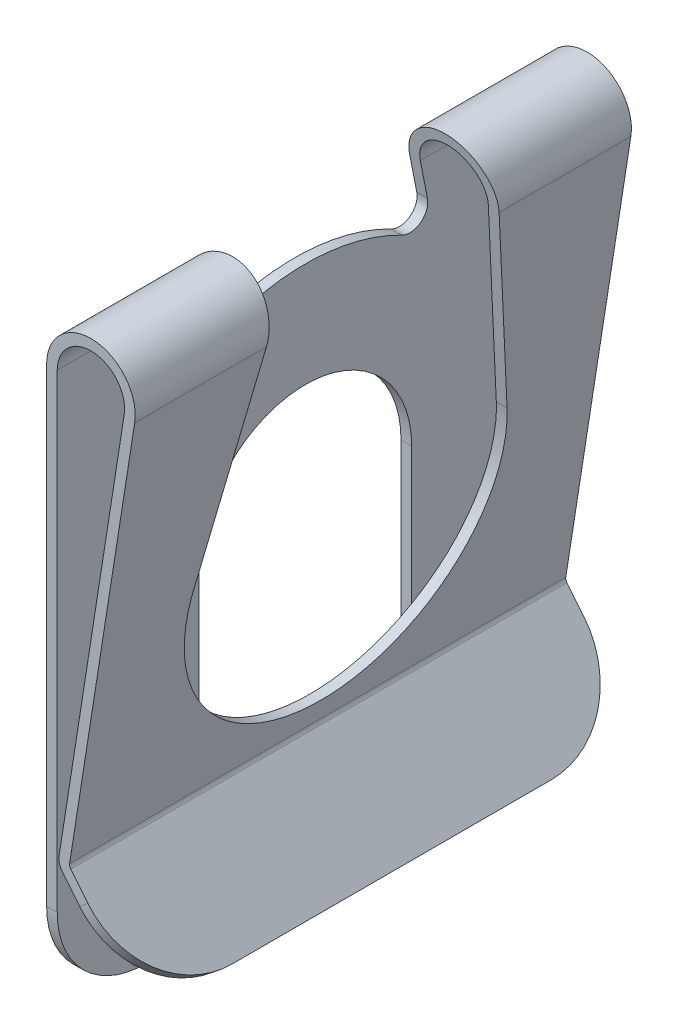
ISO-10303-21;
HEADER;
FILE_DESCRIPTION(('STEP AP214'),'2;1');
FILE_NAME('part.step','',(''),(''),'','','');
FILE_SCHEMA(('AUTOMOTIVE_DESIGN { 1 0 10303 214 1 1 1 1 }'));
ENDSEC;
DATA;
#1=APPLICATION_CONTEXT('core data for automotive mechanical design processes');
#2=APPLICATION_PROTOCOL_DEFINITION('international standard','automotive_design',2000,#1);
#3=PRODUCT_CONTEXT('',#1,'mechanical');
#4=PRODUCT('Part','Part','',(#3));
#5=PRODUCT_RELATED_PRODUCT_CATEGORY('part','',(#4));
#6=PRODUCT_DEFINITION_FORMATION('','',#4);
#7=PRODUCT_DEFINITION_CONTEXT('part definition',#1,'design');
#8=PRODUCT_DEFINITION('design','',#6,#7);
#9=PRODUCT_DEFINITION_SHAPE('','',#8);
#10=(LENGTH_UNIT() NAMED_UNIT(*) SI_UNIT(.MILLI.,.METRE.));
#11=(NAMED_UNIT(*) PLANE_ANGLE_UNIT() SI_UNIT($,.RADIAN.));
#12=(NAMED_UNIT(*) SI_UNIT($,.STERADIAN.) SOLID_ANGLE_UNIT());
#13=UNCERTAINTY_MEASURE_WITH_UNIT(LENGTH_MEASURE(1.E-05),#10,'distance_accuracy_value','');
#14=(GEOMETRIC_REPRESENTATION_CONTEXT(3) GLOBAL_UNCERTAINTY_ASSIGNED_CONTEXT((#13)) GLOBAL_UNIT_ASSIGNED_CONTEXT((#10,
#11,#12)) REPRESENTATION_CONTEXT('',''));
#15=CARTESIAN_POINT('',(0.,0.,0.));
#16=DIRECTION('',(0.,0.,1.));
#17=DIRECTION('',(1.,0.,0.));
#18=AXIS2_PLACEMENT_3D('',#15,#16,#17);
#19=CARTESIAN_POINT('',(0.895029627833517,-10.6822163194488,14.));
#20=DIRECTION('',(0.775470518432176,0.631383777937422,0.));
#21=DIRECTION('',(-0.631383777937422,0.775470518432177,0.));
#22=AXIS2_PLACEMENT_3D('',#19,#20,#21);
#23=PLANE('',#22);
#24=CARTESIAN_POINT('',(1.86230957563363,-11.8702371536869,8.99999999999994));
#25=DIRECTION('',(0.775470518432176,0.631383777937422,0.));
#26=DIRECTION('',(-0.631383777937422,0.775470518432177,0.));
#27=AXIS2_PLACEMENT_3D('',#24,#25,#26);
#28=CIRCLE('',#27,5.00000000000006);
#29=CARTESIAN_POINT('',(1.86230957563367,-11.8702371536869,14.));
#30=VERTEX_POINT('',#29);
#31=CARTESIAN_POINT('',(5.01922846532078,-15.7475897458478,9.));
#32=VERTEX_POINT('',#31);
#33=EDGE_CURVE('E405',#30,#32,#28,.T.);
#34=ORIENTED_EDGE('',*,*,#33,.F.);
#35=DIRECTION('',(0.631383777937422,-0.775470518432176,0.));
#36=VECTOR('',#35,1.);
#37=CARTESIAN_POINT('',(0.895029627833517,-10.6822163194488,14.));
#38=LINE('',#37,#36);
#39=CARTESIAN_POINT('',(0.895029627833517,-10.6822163194488,14.));
#40=VERTEX_POINT('',#39);
#41=EDGE_CURVE('E288',#40,#30,#38,.T.);
#42=ORIENTED_EDGE('',*,*,#41,.F.);
#43=DIRECTION('',(0.,0.,-1.));
#44=VECTOR('',#43,1.);
#45=CARTESIAN_POINT('',(0.895029627833517,-10.6822163194488,14.));
#46=LINE('',#45,#44);
#47=CARTESIAN_POINT('',(0.895029627833517,-10.6822163194488,-14.));
#48=VERTEX_POINT('',#47);
#49=EDGE_CURVE('E305',#40,#48,#46,.T.);
#50=ORIENTED_EDGE('',*,*,#49,.T.);
#51=DIRECTION('',(0.631383777937422,-0.775470518432176,0.));
#52=VECTOR('',#51,1.);
#53=CARTESIAN_POINT('',(0.895029627833517,-10.6822163194488,-14.));
#54=LINE('',#53,#52);
#55=CARTESIAN_POINT('',(1.86230957563368,-11.8702371536869,-14.));
#56=VERTEX_POINT('',#55);
#57=EDGE_CURVE('E264',#48,#56,#54,.T.);
#58=ORIENTED_EDGE('',*,*,#57,.T.);
#59=CARTESIAN_POINT('',(1.86230957563368,-11.8702371536869,-9.00000000000001));
#60=DIRECTION('',(0.775470518432176,0.631383777937422,0.));
#61=DIRECTION('',(-0.631383777937422,0.775470518432177,0.));
#62=AXIS2_PLACEMENT_3D('',#59,#60,#61);
#63=CIRCLE('',#62,5.);
#64=CARTESIAN_POINT('',(5.01922846532079,-15.7475897458478,-9.00000000000001));
#65=VERTEX_POINT('',#64);
#66=EDGE_CURVE('E48',#65,#56,#63,.T.);
#67=ORIENTED_EDGE('',*,*,#66,.F.);
#68=DIRECTION('',(0.,0.,-1.));
#69=VECTOR('',#68,1.);
#70=CARTESIAN_POINT('',(5.01922846532079,-15.7475897458478,14.));
#71=LINE('',#70,#69);
#72=EDGE_CURVE('E406',#32,#65,#71,.T.);
#73=ORIENTED_EDGE('',*,*,#72,.F.);
#74=EDGE_LOOP('',(#34,#42,#50,#58,#67,#73));
#75=FACE_BOUND('',#74,.T.);
#76=ADVANCED_FACE('F33',(#75),#23,.F.);
#77=CARTESIAN_POINT('',(5.5015602883906,-15.3896998237376,14.));
#78=DIRECTION('',(-0.775470518432177,-0.631383777937422,0.));
#79=DIRECTION('',(0.631383777937422,-0.775470518432177,0.));
#80=AXIS2_PLACEMENT_3D('',#77,#78,#79);
#81=PLANE('',#80);
#82=CARTESIAN_POINT('',(2.32759188669291,-11.4914068869244,8.99999999999994));
#83=DIRECTION('',(-0.775470518432177,-0.631383777937422,0.));
#84=DIRECTION('',(0.631383777937422,-0.775470518432177,0.));
#85=AXIS2_PLACEMENT_3D('',#82,#83,#84);
#86=CIRCLE('',#85,5.00000000000006);
#87=CARTESIAN_POINT('',(5.48451077638006,-15.3687594790854,9.));
#88=VERTEX_POINT('',#87);
#89=CARTESIAN_POINT('',(2.32759188669295,-11.4914068869245,14.));
#90=VERTEX_POINT('',#89);
#91=EDGE_CURVE('E341',#88,#90,#86,.T.);
#92=ORIENTED_EDGE('',*,*,#91,.F.);
#93=DIRECTION('',(0.,0.,1.));
#94=VECTOR('',#93,1.);
#95=CARTESIAN_POINT('',(5.48451077638006,-15.3687594790854,14.));
#96=LINE('',#95,#94);
#97=CARTESIAN_POINT('',(5.48451077638006,-15.3687594790854,-9.00000000000001));
#98=VERTEX_POINT('',#97);
#99=EDGE_CURVE('E11',#98,#88,#96,.T.);
#100=ORIENTED_EDGE('',*,*,#99,.F.);
#101=CARTESIAN_POINT('',(2.32759188669296,-11.4914068869245,-9.00000000000001));
#102=DIRECTION('',(-0.775470518432177,-0.631383777937422,0.));
#103=DIRECTION('',(0.631383777937422,-0.775470518432177,0.));
#104=AXIS2_PLACEMENT_3D('',#101,#102,#103);
#105=CIRCLE('',#104,5.);
#106=CARTESIAN_POINT('',(2.32759188669295,-11.4914068869245,-14.));
#107=VERTEX_POINT('',#106);
#108=EDGE_CURVE('E242',#107,#98,#105,.T.);
#109=ORIENTED_EDGE('',*,*,#108,.F.);
#110=DIRECTION('',(-0.631383777937421,0.775470518432177,0.));
#111=VECTOR('',#110,1.);
#112=CARTESIAN_POINT('',(5.5015602883906,-15.3896998237376,-14.));
#113=LINE('',#112,#111);
#114=CARTESIAN_POINT('',(1.36031193889282,-10.3033860526864,-14.));
#115=VERTEX_POINT('',#114);
#116=EDGE_CURVE('E255',#107,#115,#113,.T.);
#117=ORIENTED_EDGE('',*,*,#116,.T.);
#118=DIRECTION('',(0.,0.,-1.));
#119=VECTOR('',#118,1.);
#120=CARTESIAN_POINT('',(1.36031193889282,-10.3033860526864,14.));
#121=LINE('',#120,#119);
#122=CARTESIAN_POINT('',(1.36031193889282,-10.3033860526864,14.));
#123=VERTEX_POINT('',#122);
#124=EDGE_CURVE('E303',#123,#115,#121,.T.);
#125=ORIENTED_EDGE('',*,*,#124,.F.);
#126=DIRECTION('',(-0.631383777937421,0.775470518432177,0.));
#127=VECTOR('',#126,1.);
#128=CARTESIAN_POINT('',(5.5015602883906,-15.3896998237376,14.));
#129=LINE('',#128,#127);
#130=EDGE_CURVE('E291',#90,#123,#129,.T.);
#131=ORIENTED_EDGE('',*,*,#130,.F.);
#132=EDGE_LOOP('',(#92,#100,#109,#117,#125,#131));
#133=FACE_BOUND('',#132,.T.);
#134=ADVANCED_FACE('F253',(#133),#81,.F.);
#135=CARTESIAN_POINT('',(2.5,13.7,14.));
#136=DIRECTION('',(0.,0.,1.));
#137=DIRECTION('',(1.,0.,0.));
#138=AXIS2_PLACEMENT_3D('',#135,#136,#137);
#139=PLANE('',#138);
#140=ORIENTED_EDGE('',*,*,#41,.T.);
#141=DIRECTION('',(0.775470518432175,0.631383777937423,0.));
#142=VECTOR('',#141,1.);
#143=CARTESIAN_POINT('',(14.7654744712852,-1.36455214629673,14.));
#144=LINE('',#143,#142);
#145=EDGE_CURVE('E41',#30,#90,#144,.T.);
#146=ORIENTED_EDGE('',*,*,#145,.T.);
#147=ORIENTED_EDGE('',*,*,#130,.T.);
#148=CARTESIAN_POINT('',(1.59295309442247,-10.1139709193051,14.));
#149=DIRECTION('',(0.,0.,-1.));
#150=DIRECTION('',(-1.,0.,0.));
#151=AXIS2_PLACEMENT_3D('',#148,#149,#150);
#152=CIRCLE('',#151,0.300000000000011);
#153=CARTESIAN_POINT('',(1.29658842523851,-10.0674093164602,14.));
#154=VERTEX_POINT('',#153);
#155=EDGE_CURVE('E293',#123,#154,#152,.T.);
#156=ORIENTED_EDGE('',*,*,#155,.T.);
#157=DIRECTION('',(0.15520534281649,0.987882230613152,0.));
#158=VECTOR('',#157,1.);
#159=CARTESIAN_POINT('',(1.29658842523853,-10.0674093164602,14.));
#160=LINE('',#159,#158);
#161=CARTESIAN_POINT('',(4.96970557653288,13.3119866429588,14.));
#162=VERTEX_POINT('',#161);
#163=EDGE_CURVE('E295',#154,#162,#160,.T.);
#164=ORIENTED_EDGE('',*,*,#163,.T.);
#165=CARTESIAN_POINT('',(2.5,13.7,14.));
#166=DIRECTION('',(0.,0.,1.));
#167=DIRECTION('',(1.,0.,0.));
#168=AXIS2_PLACEMENT_3D('',#165,#166,#167);
#169=CIRCLE('',#168,2.5);
#170=CARTESIAN_POINT('',(0.,13.7,14.));
#171=VERTEX_POINT('',#170);
#172=EDGE_CURVE('E274',#162,#171,#169,.T.);
#173=ORIENTED_EDGE('',*,*,#172,.T.);
#174=DIRECTION('',(0.,-1.,0.));
#175=VECTOR('',#174,1.);
#176=CARTESIAN_POINT('',(0.,13.7,14.));
#177=LINE('',#176,#175);
#178=CARTESIAN_POINT('',(0.,-12.7999999999999,14.));
#179=VERTEX_POINT('',#178);
#180=EDGE_CURVE('E277',#171,#179,#177,.T.);
#181=ORIENTED_EDGE('',*,*,#180,.T.);
#182=DIRECTION('',(-1.,0.,0.));
#183=VECTOR('',#182,1.);
#184=CARTESIAN_POINT('',(0.6,-12.7999999999999,14.));
#185=LINE('',#184,#183);
#186=CARTESIAN_POINT('',(0.6,-12.7999999999999,14.));
#187=VERTEX_POINT('',#186);
#188=EDGE_CURVE('E368',#187,#179,#185,.T.);
#189=ORIENTED_EDGE('',*,*,#188,.F.);
#190=DIRECTION('',(0.,1.,0.));
#191=VECTOR('',#190,1.);
#192=CARTESIAN_POINT('',(0.6,-17.8,14.));
#193=LINE('',#192,#191);
#194=CARTESIAN_POINT('',(0.6,13.7,14.));
#195=VERTEX_POINT('',#194);
#196=EDGE_CURVE('E280',#187,#195,#193,.T.);
#197=ORIENTED_EDGE('',*,*,#196,.T.);
#198=CARTESIAN_POINT('',(2.5,13.7,14.));
#199=DIRECTION('',(0.,0.,-1.));
#200=DIRECTION('',(-1.,0.,0.));
#201=AXIS2_PLACEMENT_3D('',#198,#199,#200);
#202=CIRCLE('',#201,1.9);
#203=CARTESIAN_POINT('',(4.37697623816499,13.4051098486487,14.));
#204=VERTEX_POINT('',#203);
#205=EDGE_CURVE('E282',#195,#204,#202,.T.);
#206=ORIENTED_EDGE('',*,*,#205,.T.);
#207=DIRECTION('',(-0.15520534281649,-0.987882230613152,0.));
#208=VECTOR('',#207,1.);
#209=CARTESIAN_POINT('',(4.37697623816499,13.4051098486487,14.));
#210=LINE('',#209,#208);
#211=CARTESIAN_POINT('',(0.70385908687064,-9.9742861107703,14.));
#212=VERTEX_POINT('',#211);
#213=EDGE_CURVE('E284',#204,#212,#210,.T.);
#214=ORIENTED_EDGE('',*,*,#213,.T.);
#215=CARTESIAN_POINT('',(1.59295309442247,-10.1139709193051,14.));
#216=DIRECTION('',(0.,0.,1.));
#217=DIRECTION('',(1.,0.,0.));
#218=AXIS2_PLACEMENT_3D('',#215,#216,#217);
#219=CIRCLE('',#218,0.899999999999994);
#220=EDGE_CURVE('E286',#212,#40,#219,.T.);
#221=ORIENTED_EDGE('',*,*,#220,.T.);
#222=EDGE_LOOP('',(#140,#146,#147,#156,#164,#173,#181,#189,#197,#206,#214,#221));
#223=FACE_BOUND('',#222,.T.);
#224=ADVANCED_FACE('F337',(#223),#139,.T.);
#225=CARTESIAN_POINT('',(0.,13.7,14.));
#226=DIRECTION('',(1.,0.,0.));
#227=DIRECTION('',(0.,0.,-1.));
#228=AXIS2_PLACEMENT_3D('',#225,#226,#227);
#229=PLANE('',#228);
#230=CARTESIAN_POINT('',(0.,-16.8000000000001,6.99999999999991));
#231=DIRECTION('',(-1.,0.,0.));
#232=DIRECTION('',(0.,0.,1.));
#233=AXIS2_PLACEMENT_3D('',#230,#231,#232);
#234=CIRCLE('',#233,0.999999999999907);
#235=CARTESIAN_POINT('',(0.,-16.8,6.));
#236=VERTEX_POINT('',#235);
#237=CARTESIAN_POINT('',(0.,-17.8,7.));
#238=VERTEX_POINT('',#237);
#239=EDGE_CURVE('E56',#236,#238,#234,.T.);
#240=ORIENTED_EDGE('',*,*,#239,.T.);
#241=DIRECTION('',(0.,0.,-1.));
#242=VECTOR('',#241,1.);
#243=CARTESIAN_POINT('',(0.,-17.8,14.));
#244=LINE('',#243,#242);
#245=CARTESIAN_POINT('',(0.,-17.8,9.));
#246=VERTEX_POINT('',#245);
#247=EDGE_CURVE('E322',#246,#238,#244,.T.);
#248=ORIENTED_EDGE('',*,*,#247,.F.);
#249=CARTESIAN_POINT('',(0.,-12.7999999999999,8.99999999999987));
#250=DIRECTION('',(-1.,0.,0.));
#251=DIRECTION('',(0.,0.,1.));
#252=AXIS2_PLACEMENT_3D('',#249,#250,#251);
#253=CIRCLE('',#252,5.00000000000013);
#254=EDGE_CURVE('E366',#246,#179,#253,.T.);
#255=ORIENTED_EDGE('',*,*,#254,.T.);
#256=ORIENTED_EDGE('',*,*,#180,.F.);
#257=DIRECTION('',(0.,0.,-1.));
#258=VECTOR('',#257,1.);
#259=CARTESIAN_POINT('',(0.,13.7,14.));
#260=LINE('',#259,#258);
#261=CARTESIAN_POINT('',(0.,13.7,6.48931632848877));
#262=VERTEX_POINT('',#261);
#263=EDGE_CURVE('E326',#171,#262,#260,.T.);
#264=ORIENTED_EDGE('',*,*,#263,.T.);
#265=DIRECTION('',(0.,-0.981378901425819,0.192081888360808));
#266=VECTOR('',#265,1.);
#267=CARTESIAN_POINT('',(0.,12.284197728924,6.76642639614835));
#268=LINE('',#267,#266);
#269=CARTESIAN_POINT('',(0.,11.6600781321456,6.88858316000175));
#270=VERTEX_POINT('',#269);
#271=EDGE_CURVE('E363',#262,#270,#268,.T.);
#272=ORIENTED_EDGE('',*,*,#271,.T.);
#273=CARTESIAN_POINT('',(0.,11.4679962437848,5.90720425857591));
#274=DIRECTION('',(1.,0.,0.));
#275=DIRECTION('',(0.,0.,-1.));
#276=AXIS2_PLACEMENT_3D('',#273,#274,#275);
#277=CIRCLE('',#276,1.00000000000001);
#278=CARTESIAN_POINT('',(0.,10.5790043133299,5.44928139652815));
#279=VERTEX_POINT('',#278);
#280=EDGE_CURVE('E477',#270,#279,#277,.T.);
#281=ORIENTED_EDGE('',*,*,#280,.T.);
#282=CARTESIAN_POINT('',(0.,-2.37657116208823E-13,0.));
#283=DIRECTION('',(1.,0.,0.));
#284=DIRECTION('',(0.,0.,-1.));
#285=AXIS2_PLACEMENT_3D('',#282,#283,#284);
#286=CIRCLE('',#285,11.9000000000002);
#287=CARTESIAN_POINT('',(0.,10.5790042869023,-5.44928144783361));
#288=VERTEX_POINT('',#287);
#289=EDGE_CURVE('E462',#279,#288,#286,.F.);
#290=ORIENTED_EDGE('',*,*,#289,.T.);
#291=CARTESIAN_POINT('',(0.,11.4679962437848,-5.90720425857592));
#292=DIRECTION('',(1.,0.,0.));
#293=DIRECTION('',(0.,0.,-1.));
#294=AXIS2_PLACEMENT_3D('',#291,#292,#293);
#295=CIRCLE('',#294,1.);
#296=CARTESIAN_POINT('',(0.,11.6600781321456,-6.88858316000175));
#297=VERTEX_POINT('',#296);
#298=EDGE_CURVE('E470',#288,#297,#295,.T.);
#299=ORIENTED_EDGE('',*,*,#298,.T.);
#300=DIRECTION('',(0.,0.981378901425819,0.192081888360808));
#301=VECTOR('',#300,1.);
#302=CARTESIAN_POINT('',(0.,17.5623408812572,-5.73335374473324));
#303=LINE('',#302,#301);
#304=CARTESIAN_POINT('',(0.,13.7,-6.48931632848876));
#305=VERTEX_POINT('',#304);
#306=EDGE_CURVE('E473',#297,#305,#303,.T.);
#307=ORIENTED_EDGE('',*,*,#306,.T.);
#308=CARTESIAN_POINT('',(0.,13.7,-14.));
#309=VERTEX_POINT('',#308);
#310=EDGE_CURVE('E325',#305,#309,#260,.T.);
#311=ORIENTED_EDGE('',*,*,#310,.T.);
#312=DIRECTION('',(0.,-1.,0.));
#313=VECTOR('',#312,1.);
#314=CARTESIAN_POINT('',(0.,13.7,-14.));
#315=LINE('',#314,#313);
#316=CARTESIAN_POINT('',(0.,-12.8,-14.));
#317=VERTEX_POINT('',#316);
#318=EDGE_CURVE('E522',#309,#317,#315,.T.);
#319=ORIENTED_EDGE('',*,*,#318,.T.);
#320=CARTESIAN_POINT('',(0.,-12.7999999999999,-8.99999999999987));
#321=DIRECTION('',(-1.,0.,0.));
#322=DIRECTION('',(0.,0.,1.));
#323=AXIS2_PLACEMENT_3D('',#320,#321,#322);
#324=CIRCLE('',#323,5.00000000000013);
#325=CARTESIAN_POINT('',(0.,-17.8,-9.));
#326=VERTEX_POINT('',#325);
#327=EDGE_CURVE('E431',#317,#326,#324,.T.);
#328=ORIENTED_EDGE('',*,*,#327,.T.);
#329=CARTESIAN_POINT('',(0.,-17.8,-7.));
#330=VERTEX_POINT('',#329);
#331=EDGE_CURVE('E321',#330,#326,#244,.T.);
#332=ORIENTED_EDGE('',*,*,#331,.F.);
#333=CARTESIAN_POINT('',(0.,-16.7999999999999,-7.00000000000008));
#334=DIRECTION('',(-1.,0.,0.));
#335=DIRECTION('',(0.,0.,1.));
#336=AXIS2_PLACEMENT_3D('',#333,#334,#335);
#337=CIRCLE('',#336,1.00000000000008);
#338=CARTESIAN_POINT('',(0.,-16.7999999999999,-6.));
#339=VERTEX_POINT('',#338);
#340=EDGE_CURVE('E421',#330,#339,#337,.T.);
#341=ORIENTED_EDGE('',*,*,#340,.T.);
#342=DIRECTION('',(0.,1.,0.));
#343=VECTOR('',#342,1.);
#344=CARTESIAN_POINT('',(0.,-17.8,-6.));
#345=LINE('',#344,#343);
#346=CARTESIAN_POINT('',(0.,0.,-6.));
#347=VERTEX_POINT('',#346);
#348=EDGE_CURVE('E502',#339,#347,#345,.T.);
#349=ORIENTED_EDGE('',*,*,#348,.T.);
#350=CARTESIAN_POINT('',(0.,0.,0.));
#351=DIRECTION('',(1.,0.,0.));
#352=DIRECTION('',(0.,0.,-1.));
#353=AXIS2_PLACEMENT_3D('',#350,#351,#352);
#354=CIRCLE('',#353,6.);
#355=CARTESIAN_POINT('',(0.,0.,6.));
#356=VERTEX_POINT('',#355);
#357=EDGE_CURVE('E498',#347,#356,#354,.T.);
#358=ORIENTED_EDGE('',*,*,#357,.T.);
#359=DIRECTION('',(0.,-1.,0.));
#360=VECTOR('',#359,1.);
#361=CARTESIAN_POINT('',(0.,0.,6.));
#362=LINE('',#361,#360);
#363=EDGE_CURVE('E510',#356,#236,#362,.T.);
#364=ORIENTED_EDGE('',*,*,#363,.T.);
#365=EDGE_LOOP('',(#240,#248,#255,#256,#264,#272,#281,#290,#299,#307,#311,#319,#328,#332,#341,
#349,#358,#364));
#366=FACE_BOUND('',#365,.T.);
#367=ADVANCED_FACE('F361',(#366),#229,.F.);
#368=CARTESIAN_POINT('',(0.6,-17.8,14.));
#369=DIRECTION('',(-1.,0.,0.));
#370=DIRECTION('',(0.,0.,1.));
#371=AXIS2_PLACEMENT_3D('',#368,#369,#370);
#372=PLANE('',#371);
#373=CARTESIAN_POINT('',(0.6,-16.8000000000001,6.99999999999991));
#374=DIRECTION('',(-1.,0.,0.));
#375=DIRECTION('',(0.,0.,1.));
#376=AXIS2_PLACEMENT_3D('',#373,#374,#375);
#377=CIRCLE('',#376,0.999999999999907);
#378=CARTESIAN_POINT('',(0.6,-16.8,6.));
#379=VERTEX_POINT('',#378);
#380=CARTESIAN_POINT('',(0.6,-17.8,7.));
#381=VERTEX_POINT('',#380);
#382=EDGE_CURVE('E414',#379,#381,#377,.T.);
#383=ORIENTED_EDGE('',*,*,#382,.F.);
#384=DIRECTION('',(0.,-1.,0.));
#385=VECTOR('',#384,1.);
#386=CARTESIAN_POINT('',(0.6,0.,6.));
#387=LINE('',#386,#385);
#388=CARTESIAN_POINT('',(0.6,0.,6.));
#389=VERTEX_POINT('',#388);
#390=EDGE_CURVE('E501',#389,#379,#387,.T.);
#391=ORIENTED_EDGE('',*,*,#390,.F.);
#392=CARTESIAN_POINT('',(0.6,0.,0.));
#393=DIRECTION('',(1.,0.,0.));
#394=DIRECTION('',(0.,0.,-1.));
#395=AXIS2_PLACEMENT_3D('',#392,#393,#394);
#396=CIRCLE('',#395,6.);
#397=CARTESIAN_POINT('',(0.6,0.,-6.));
#398=VERTEX_POINT('',#397);
#399=EDGE_CURVE('E499',#398,#389,#396,.T.);
#400=ORIENTED_EDGE('',*,*,#399,.F.);
#401=DIRECTION('',(0.,1.,0.));
#402=VECTOR('',#401,1.);
#403=CARTESIAN_POINT('',(0.6,-17.8,-6.));
#404=LINE('',#403,#402);
#405=CARTESIAN_POINT('',(0.6,-16.7999999999999,-6.));
#406=VERTEX_POINT('',#405);
#407=EDGE_CURVE('E505',#406,#398,#404,.T.);
#408=ORIENTED_EDGE('',*,*,#407,.F.);
#409=CARTESIAN_POINT('',(0.6,-16.7999999999999,-7.00000000000008));
#410=DIRECTION('',(-1.,0.,0.));
#411=DIRECTION('',(0.,0.,1.));
#412=AXIS2_PLACEMENT_3D('',#409,#410,#411);
#413=CIRCLE('',#412,1.00000000000008);
#414=CARTESIAN_POINT('',(0.6,-17.8,-7.));
#415=VERTEX_POINT('',#414);
#416=EDGE_CURVE('E422',#415,#406,#413,.T.);
#417=ORIENTED_EDGE('',*,*,#416,.F.);
#418=DIRECTION('',(0.,0.,-1.));
#419=VECTOR('',#418,1.);
#420=CARTESIAN_POINT('',(0.6,-17.8,14.));
#421=LINE('',#420,#419);
#422=CARTESIAN_POINT('',(0.6,-17.8,-9.));
#423=VERTEX_POINT('',#422);
#424=EDGE_CURVE('E317',#415,#423,#421,.T.);
#425=ORIENTED_EDGE('',*,*,#424,.T.);
#426=CARTESIAN_POINT('',(0.6,-12.7999999999999,-8.99999999999987));
#427=DIRECTION('',(-1.,0.,0.));
#428=DIRECTION('',(0.,0.,1.));
#429=AXIS2_PLACEMENT_3D('',#426,#427,#428);
#430=CIRCLE('',#429,5.00000000000013);
#431=CARTESIAN_POINT('',(0.6,-12.8,-14.));
#432=VERTEX_POINT('',#431);
#433=EDGE_CURVE('E432',#432,#423,#430,.T.);
#434=ORIENTED_EDGE('',*,*,#433,.F.);
#435=DIRECTION('',(0.,1.,0.));
#436=VECTOR('',#435,1.);
#437=CARTESIAN_POINT('',(0.6,-17.8,-14.));
#438=LINE('',#437,#436);
#439=CARTESIAN_POINT('',(0.6,13.7,-14.));
#440=VERTEX_POINT('',#439);
#441=EDGE_CURVE('E525',#432,#440,#438,.T.);
#442=ORIENTED_EDGE('',*,*,#441,.T.);
#443=DIRECTION('',(0.,0.,-1.));
#444=VECTOR('',#443,1.);
#445=CARTESIAN_POINT('',(0.6,13.7,14.));
#446=LINE('',#445,#444);
#447=CARTESIAN_POINT('',(0.6,13.7,-6.48931632848876));
#448=VERTEX_POINT('',#447);
#449=EDGE_CURVE('E313',#448,#440,#446,.T.);
#450=ORIENTED_EDGE('',*,*,#449,.F.);
#451=DIRECTION('',(0.,0.981378901425818,0.192081888360808));
#452=VECTOR('',#451,1.);
#453=CARTESIAN_POINT('',(0.6,11.6600781321456,-6.88858316000175));
#454=LINE('',#453,#452);
#455=CARTESIAN_POINT('',(0.6,11.6600781321456,-6.88858316000175));
#456=VERTEX_POINT('',#455);
#457=EDGE_CURVE('E456',#456,#448,#454,.T.);
#458=ORIENTED_EDGE('',*,*,#457,.F.);
#459=CARTESIAN_POINT('',(0.6,11.4679962437848,-5.90720425857592));
#460=DIRECTION('',(1.,0.,0.));
#461=DIRECTION('',(0.,0.,-1.));
#462=AXIS2_PLACEMENT_3D('',#459,#460,#461);
#463=CIRCLE('',#462,1.);
#464=CARTESIAN_POINT('',(0.6,10.5790042869023,-5.44928144783361));
#465=VERTEX_POINT('',#464);
#466=EDGE_CURVE('E453',#465,#456,#463,.T.);
#467=ORIENTED_EDGE('',*,*,#466,.F.);
#468=CARTESIAN_POINT('',(0.6,-2.37657116208823E-13,0.));
#469=DIRECTION('',(-1.,0.,0.));
#470=DIRECTION('',(0.,0.,1.));
#471=AXIS2_PLACEMENT_3D('',#468,#469,#470);
#472=CIRCLE('',#471,11.9000000000002);
#473=CARTESIAN_POINT('',(0.6,10.5790043133299,5.44928139652815));
#474=VERTEX_POINT('',#473);
#475=EDGE_CURVE('E450',#474,#465,#472,.T.);
#476=ORIENTED_EDGE('',*,*,#475,.F.);
#477=CARTESIAN_POINT('',(0.6,11.4679962437848,5.90720425857591));
#478=DIRECTION('',(1.,0.,0.));
#479=DIRECTION('',(0.,0.,-1.));
#480=AXIS2_PLACEMENT_3D('',#477,#478,#479);
#481=CIRCLE('',#480,1.00000000000001);
#482=CARTESIAN_POINT('',(0.6,11.6600781321456,6.88858316000175));
#483=VERTEX_POINT('',#482);
#484=EDGE_CURVE('E447',#483,#474,#481,.T.);
#485=ORIENTED_EDGE('',*,*,#484,.F.);
#486=DIRECTION('',(0.,-0.981378901425818,0.192081888360808));
#487=VECTOR('',#486,1.);
#488=CARTESIAN_POINT('',(0.6,16.2,6.));
#489=LINE('',#488,#487);
#490=CARTESIAN_POINT('',(0.6,13.7,6.48931632848876));
#491=VERTEX_POINT('',#490);
#492=EDGE_CURVE('E383',#491,#483,#489,.T.);
#493=ORIENTED_EDGE('',*,*,#492,.F.);
#494=EDGE_CURVE('E314',#195,#491,#446,.T.);
#495=ORIENTED_EDGE('',*,*,#494,.F.);
#496=ORIENTED_EDGE('',*,*,#196,.F.);
#497=CARTESIAN_POINT('',(0.6,-12.7999999999999,8.99999999999987));
#498=DIRECTION('',(-1.,0.,0.));
#499=DIRECTION('',(0.,0.,1.));
#500=AXIS2_PLACEMENT_3D('',#497,#498,#499);
#501=CIRCLE('',#500,5.00000000000013);
#502=CARTESIAN_POINT('',(0.6,-17.8,9.));
#503=VERTEX_POINT('',#502);
#504=EDGE_CURVE('E373',#503,#187,#501,.T.);
#505=ORIENTED_EDGE('',*,*,#504,.F.);
#506=EDGE_CURVE('E318',#503,#381,#421,.T.);
#507=ORIENTED_EDGE('',*,*,#506,.T.);
#508=EDGE_LOOP('',(#383,#391,#400,#408,#417,#425,#434,#442,#450,#458,#467,#476,#485,#493,#495,
#496,#505,#507));
#509=FACE_BOUND('',#508,.T.);
#510=ADVANCED_FACE('F378',(#509),#372,.F.);
#511=CARTESIAN_POINT('',(0.,-17.8,14.));
#512=DIRECTION('',(0.,1.,0.));
#513=DIRECTION('',(0.,0.,1.));
#514=AXIS2_PLACEMENT_3D('',#511,#512,#513);
#515=PLANE('',#514);
#516=DIRECTION('',(-1.,0.,0.));
#517=VECTOR('',#516,1.);
#518=CARTESIAN_POINT('',(0.6,-17.8,7.));
#519=LINE('',#518,#517);
#520=EDGE_CURVE('E419',#381,#238,#519,.T.);
#521=ORIENTED_EDGE('',*,*,#520,.F.);
#522=ORIENTED_EDGE('',*,*,#506,.F.);
#523=DIRECTION('',(-1.,0.,0.));
#524=VECTOR('',#523,1.);
#525=CARTESIAN_POINT('',(0.6,-17.8,9.));
#526=LINE('',#525,#524);
#527=EDGE_CURVE('E372',#503,#246,#526,.T.);
#528=ORIENTED_EDGE('',*,*,#527,.T.);
#529=ORIENTED_EDGE('',*,*,#247,.T.);
#530=EDGE_LOOP('',(#521,#522,#528,#529));
#531=FACE_BOUND('',#530,.T.);
#532=ADVANCED_FACE('F570',(#531),#515,.F.);
#533=CARTESIAN_POINT('',(0.6,0.,6.));
#534=DIRECTION('',(0.,0.,-1.));
#535=DIRECTION('',(-1.,0.,0.));
#536=AXIS2_PLACEMENT_3D('',#533,#534,#535);
#537=PLANE('',#536);
#538=ORIENTED_EDGE('',*,*,#390,.T.);
#539=DIRECTION('',(-1.,0.,0.));
#540=VECTOR('',#539,1.);
#541=CARTESIAN_POINT('',(0.6,-16.8,6.));
#542=LINE('',#541,#540);
#543=EDGE_CURVE('E416',#379,#236,#542,.T.);
#544=ORIENTED_EDGE('',*,*,#543,.T.);
#545=ORIENTED_EDGE('',*,*,#363,.F.);
#546=DIRECTION('',(-1.,0.,0.));
#547=VECTOR('',#546,1.);
#548=CARTESIAN_POINT('',(0.6,0.,6.));
#549=LINE('',#548,#547);
#550=EDGE_CURVE('E516',#389,#356,#549,.T.);
#551=ORIENTED_EDGE('',*,*,#550,.F.);
#552=EDGE_LOOP('',(#538,#544,#545,#551));
#553=FACE_BOUND('',#552,.T.);
#554=ADVANCED_FACE('F572',(#553),#537,.T.);
#555=ORIENTED_EDGE('',*,*,#424,.F.);
#556=DIRECTION('',(-1.,0.,0.));
#557=VECTOR('',#556,1.);
#558=CARTESIAN_POINT('',(0.6,-17.8,-7.));
#559=LINE('',#558,#557);
#560=EDGE_CURVE('E428',#415,#330,#559,.T.);
#561=ORIENTED_EDGE('',*,*,#560,.T.);
#562=ORIENTED_EDGE('',*,*,#331,.T.);
#563=DIRECTION('',(-1.,0.,0.));
#564=VECTOR('',#563,1.);
#565=CARTESIAN_POINT('',(0.6,-17.8,-9.));
#566=LINE('',#565,#564);
#567=EDGE_CURVE('E440',#423,#326,#566,.T.);
#568=ORIENTED_EDGE('',*,*,#567,.F.);
#569=EDGE_LOOP('',(#555,#561,#562,#568));
#570=FACE_BOUND('',#569,.T.);
#571=ADVANCED_FACE('F574',(#570),#515,.F.);
#572=CARTESIAN_POINT('',(2.5,13.7,14.));
#573=DIRECTION('',(0.,0.,-1.));
#574=DIRECTION('',(-1.,0.,0.));
#575=AXIS2_PLACEMENT_3D('',#572,#573,#574);
#576=CYLINDRICAL_SURFACE('',#575,2.5);
#577=CARTESIAN_POINT('',(2.5,13.7,6.48931632848876));
#578=DIRECTION('',(0.,-0.192081888360808,-0.981378901425818));
#579=DIRECTION('',(0.,0.981378901425818,-0.192081888360808));
#580=AXIS2_PLACEMENT_3D('',#577,#578,#579);
#581=ELLIPSE('',#580,2.54743605794645,2.5);
#582=CARTESIAN_POINT('',(4.96970557653288,13.3119866429588,6.56526083699757));
#583=VERTEX_POINT('',#582);
#584=EDGE_CURVE('E357',#262,#583,#581,.T.);
#585=ORIENTED_EDGE('',*,*,#584,.F.);
#586=ORIENTED_EDGE('',*,*,#263,.F.);
#587=ORIENTED_EDGE('',*,*,#172,.F.);
#588=DIRECTION('',(0.,0.,-1.));
#589=VECTOR('',#588,1.);
#590=CARTESIAN_POINT('',(4.96970557653288,13.3119866429588,14.));
#591=LINE('',#590,#589);
#592=EDGE_CURVE('E298',#162,#583,#591,.T.);
#593=ORIENTED_EDGE('',*,*,#592,.T.);
#594=EDGE_LOOP('',(#585,#586,#587,#593));
#595=FACE_BOUND('',#594,.T.);
#596=ADVANCED_FACE('F356',(#595),#576,.T.);
#597=ORIENTED_EDGE('',*,*,#310,.F.);
#598=CARTESIAN_POINT('',(2.5,13.7,-6.48931632848876));
#599=DIRECTION('',(0.,-0.192081888360808,0.981378901425818));
#600=DIRECTION('',(0.,-0.981378901425818,-0.192081888360808));
#601=AXIS2_PLACEMENT_3D('',#598,#599,#600);
#602=ELLIPSE('',#601,2.54743605794645,2.5);
#603=CARTESIAN_POINT('',(4.96970557653288,13.3119866429588,-6.56526083699757));
#604=VERTEX_POINT('',#603);
#605=EDGE_CURVE('E489',#604,#305,#602,.T.);
#606=ORIENTED_EDGE('',*,*,#605,.F.);
#607=CARTESIAN_POINT('',(4.96970557653288,13.3119866429588,-14.));
#608=VERTEX_POINT('',#607);
#609=EDGE_CURVE('E297',#604,#608,#591,.T.);
#610=ORIENTED_EDGE('',*,*,#609,.T.);
#611=CARTESIAN_POINT('',(2.5,13.7,-14.));
#612=DIRECTION('',(0.,0.,1.));
#613=DIRECTION('',(1.,0.,0.));
#614=AXIS2_PLACEMENT_3D('',#611,#612,#613);
#615=CIRCLE('',#614,2.5);
#616=EDGE_CURVE('E519',#608,#309,#615,.T.);
#617=ORIENTED_EDGE('',*,*,#616,.T.);
#618=EDGE_LOOP('',(#597,#606,#610,#617));
#619=FACE_BOUND('',#618,.T.);
#620=ADVANCED_FACE('F35',(#619),#576,.T.);
#621=CARTESIAN_POINT('',(2.5,13.7,14.));
#622=DIRECTION('',(0.,0.,-1.));
#623=DIRECTION('',(-1.,0.,0.));
#624=AXIS2_PLACEMENT_3D('',#621,#622,#623);
#625=CYLINDRICAL_SURFACE('',#624,1.9);
#626=CARTESIAN_POINT('',(2.5,13.7,-6.48931632848876));
#627=DIRECTION('',(0.,-0.192081888360808,0.981378901425818));
#628=DIRECTION('',(0.,-0.981378901425818,-0.192081888360808));
#629=AXIS2_PLACEMENT_3D('',#626,#627,#628);
#630=ELLIPSE('',#629,1.9360514040393,1.9);
#631=CARTESIAN_POINT('',(4.37697623816499,13.4051098486487,-6.54703415495545));
#632=VERTEX_POINT('',#631);
#633=EDGE_CURVE('E493',#448,#632,#630,.F.);
#634=ORIENTED_EDGE('',*,*,#633,.F.);
#635=ORIENTED_EDGE('',*,*,#449,.T.);
#636=CARTESIAN_POINT('',(2.5,13.7,-14.));
#637=DIRECTION('',(0.,0.,-1.));
#638=DIRECTION('',(-1.,0.,0.));
#639=AXIS2_PLACEMENT_3D('',#636,#637,#638);
#640=CIRCLE('',#639,1.9);
#641=CARTESIAN_POINT('',(4.37697623816499,13.4051098486487,-14.));
#642=VERTEX_POINT('',#641);
#643=EDGE_CURVE('E527',#440,#642,#640,.T.);
#644=ORIENTED_EDGE('',*,*,#643,.T.);
#645=DIRECTION('',(0.,0.,-1.));
#646=VECTOR('',#645,1.);
#647=CARTESIAN_POINT('',(4.37697623816499,13.4051098486487,14.));
#648=LINE('',#647,#646);
#649=EDGE_CURVE('E309',#632,#642,#648,.T.);
#650=ORIENTED_EDGE('',*,*,#649,.F.);
#651=EDGE_LOOP('',(#634,#635,#644,#650));
#652=FACE_BOUND('',#651,.T.);
#653=ADVANCED_FACE('F535',(#652),#625,.F.);
#654=CARTESIAN_POINT('',(2.5,13.7,6.48931632848876));
#655=DIRECTION('',(0.,-0.192081888360808,-0.981378901425818));
#656=DIRECTION('',(0.,0.981378901425818,-0.192081888360808));
#657=AXIS2_PLACEMENT_3D('',#654,#655,#656);
#658=ELLIPSE('',#657,1.9360514040393,1.9);
#659=CARTESIAN_POINT('',(4.37697623816499,13.4051098486487,6.54703415495545));
#660=VERTEX_POINT('',#659);
#661=EDGE_CURVE('E487',#660,#491,#658,.F.);
#662=ORIENTED_EDGE('',*,*,#661,.F.);
#663=EDGE_CURVE('E310',#204,#660,#648,.T.);
#664=ORIENTED_EDGE('',*,*,#663,.F.);
#665=ORIENTED_EDGE('',*,*,#205,.F.);
#666=ORIENTED_EDGE('',*,*,#494,.T.);
#667=EDGE_LOOP('',(#662,#664,#665,#666));
#668=FACE_BOUND('',#667,.T.);
#669=ADVANCED_FACE('F388',(#668),#625,.F.);
#670=CARTESIAN_POINT('',(4.37697623816499,13.4051098486487,14.));
#671=DIRECTION('',(0.987882230613152,-0.15520534281649,0.));
#672=DIRECTION('',(0.15520534281649,0.987882230613152,0.));
#673=AXIS2_PLACEMENT_3D('',#670,#671,#672);
#674=PLANE('',#673);
#675=DIRECTION('',(-0.152382980090014,-0.969917887793284,-0.189838663916236));
#676=VECTOR('',#675,1.);
#677=CARTESIAN_POINT('',(4.97136456827808,17.1883924260843,-5.80654537878493));
#678=LINE('',#677,#676);
#679=CARTESIAN_POINT('',(2.54251116185673,1.72873699524727,-8.83241011283237));
#680=VERTEX_POINT('',#679);
#681=EDGE_CURVE('E491',#632,#680,#678,.T.);
#682=ORIENTED_EDGE('',*,*,#681,.F.);
#683=ORIENTED_EDGE('',*,*,#649,.T.);
#684=DIRECTION('',(-0.15520534281649,-0.987882230613152,0.));
#685=VECTOR('',#684,1.);
#686=CARTESIAN_POINT('',(4.37697623816499,13.4051098486487,-14.));
#687=LINE('',#686,#685);
#688=CARTESIAN_POINT('',(0.70385908687064,-9.9742861107703,-14.));
#689=VERTEX_POINT('',#688);
#690=EDGE_CURVE('E398',#642,#689,#687,.T.);
#691=ORIENTED_EDGE('',*,*,#690,.T.);
#692=DIRECTION('',(0.,0.,-1.));
#693=VECTOR('',#692,1.);
#694=CARTESIAN_POINT('',(0.70385908687064,-9.9742861107703,14.));
#695=LINE('',#694,#693);
#696=EDGE_CURVE('E307',#212,#689,#695,.T.);
#697=ORIENTED_EDGE('',*,*,#696,.F.);
#698=ORIENTED_EDGE('',*,*,#213,.F.);
#699=ORIENTED_EDGE('',*,*,#663,.T.);
#700=DIRECTION('',(0.152382980090014,0.969917887793284,-0.189838663916236));
#701=VECTOR('',#700,1.);
#702=CARTESIAN_POINT('',(4.16137549064993,12.0328107801245,6.81562949167497));
#703=LINE('',#702,#701);
#704=CARTESIAN_POINT('',(2.54251116185673,1.72873699524727,8.83241011283237));
#705=VERTEX_POINT('',#704);
#706=EDGE_CURVE('E485',#705,#660,#703,.T.);
#707=ORIENTED_EDGE('',*,*,#706,.F.);
#708=CARTESIAN_POINT('',(2.27091075274686,0.,0.));
#709=DIRECTION('',(0.987882230613152,-0.15520534281649,0.));
#710=DIRECTION('',(-0.15520534281649,-0.987882230613152,0.));
#711=AXIS2_PLACEMENT_3D('',#708,#709,#710);
#712=ELLIPSE('',#711,9.11039769833085,9.00000000000001);
#713=EDGE_CURVE('E495',#680,#705,#712,.F.);
#714=ORIENTED_EDGE('',*,*,#713,.F.);
#715=EDGE_LOOP('',(#682,#683,#691,#697,#698,#699,#707,#714));
#716=FACE_BOUND('',#715,.T.);
#717=ADVANCED_FACE('F396',(#716),#674,.F.);
#718=CARTESIAN_POINT('',(1.29658842523853,-10.0674093164602,14.));
#719=DIRECTION('',(-0.987882230613152,0.15520534281649,0.));
#720=DIRECTION('',(-0.15520534281649,-0.987882230613152,0.));
#721=AXIS2_PLACEMENT_3D('',#718,#719,#720);
#722=PLANE('',#721);
#723=DIRECTION('',(0.152382980090014,0.969917887793284,0.189838663916236));
#724=VECTOR('',#723,1.);
#725=CARTESIAN_POINT('',(2.02387845447771,-5.43820723263109,-10.23517124726));
#726=LINE('',#725,#724);
#727=CARTESIAN_POINT('',(3.14987100841212,1.72873699524727,-8.83241011283237));
#728=VERTEX_POINT('',#727);
#729=EDGE_CURVE('E248',#728,#604,#726,.T.);
#730=ORIENTED_EDGE('',*,*,#729,.F.);
#731=CARTESIAN_POINT('',(2.87827059930225,0.,0.));
#732=DIRECTION('',(-0.987882230613152,0.15520534281649,0.));
#733=DIRECTION('',(-0.15520534281649,-0.987882230613152,0.));
#734=AXIS2_PLACEMENT_3D('',#731,#732,#733);
#735=ELLIPSE('',#734,9.11039769833085,9.00000000000001);
#736=CARTESIAN_POINT('',(3.14987100841212,1.72873699524727,8.83241011283237));
#737=VERTEX_POINT('',#736);
#738=EDGE_CURVE('E331',#737,#728,#735,.F.);
#739=ORIENTED_EDGE('',*,*,#738,.F.);
#740=DIRECTION('',(-0.152382980090014,-0.969917887793284,0.189838663916236));
#741=VECTOR('',#740,1.);
#742=CARTESIAN_POINT('',(1.21388937684956,-10.5937888785909,11.2442553601501));
#743=LINE('',#742,#741);
#744=EDGE_CURVE('E329',#583,#737,#743,.T.);
#745=ORIENTED_EDGE('',*,*,#744,.F.);
#746=ORIENTED_EDGE('',*,*,#592,.F.);
#747=ORIENTED_EDGE('',*,*,#163,.F.);
#748=DIRECTION('',(0.,0.,-1.));
#749=VECTOR('',#748,1.);
#750=CARTESIAN_POINT('',(1.29658842523851,-10.0674093164602,14.));
#751=LINE('',#750,#749);
#752=CARTESIAN_POINT('',(1.29658842523851,-10.0674093164602,-14.));
#753=VERTEX_POINT('',#752);
#754=EDGE_CURVE('E301',#154,#753,#751,.T.);
#755=ORIENTED_EDGE('',*,*,#754,.T.);
#756=DIRECTION('',(0.15520534281649,0.987882230613152,0.));
#757=VECTOR('',#756,1.);
#758=CARTESIAN_POINT('',(1.29658842523853,-10.0674093164602,-14.));
#759=LINE('',#758,#757);
#760=EDGE_CURVE('E266',#753,#608,#759,.T.);
#761=ORIENTED_EDGE('',*,*,#760,.T.);
#762=ORIENTED_EDGE('',*,*,#609,.F.);
#763=EDGE_LOOP('',(#730,#739,#745,#746,#747,#755,#761,#762));
#764=FACE_BOUND('',#763,.T.);
#765=ADVANCED_FACE('F353',(#764),#722,.F.);
#766=CARTESIAN_POINT('',(1.59295309442247,-10.1139709193051,14.));
#767=DIRECTION('',(0.,0.,-1.));
#768=DIRECTION('',(-1.,0.,0.));
#769=AXIS2_PLACEMENT_3D('',#766,#767,#768);
#770=CYLINDRICAL_SURFACE('',#769,0.899999999999994);
#771=ORIENTED_EDGE('',*,*,#696,.T.);
#772=CARTESIAN_POINT('',(1.59295309442247,-10.1139709193051,-14.));
#773=DIRECTION('',(0.,0.,1.));
#774=DIRECTION('',(1.,0.,0.));
#775=AXIS2_PLACEMENT_3D('',#772,#773,#774);
#776=CIRCLE('',#775,0.899999999999994);
#777=EDGE_CURVE('E268',#689,#48,#776,.T.);
#778=ORIENTED_EDGE('',*,*,#777,.T.);
#779=ORIENTED_EDGE('',*,*,#49,.F.);
#780=ORIENTED_EDGE('',*,*,#220,.F.);
#781=EDGE_LOOP('',(#771,#778,#779,#780));
#782=FACE_BOUND('',#781,.T.);
#783=ADVANCED_FACE('F402',(#782),#770,.T.);
#784=CARTESIAN_POINT('',(1.59295309442247,-10.1139709193051,14.));
#785=DIRECTION('',(0.,0.,-1.));
#786=DIRECTION('',(-1.,0.,0.));
#787=AXIS2_PLACEMENT_3D('',#784,#785,#786);
#788=CYLINDRICAL_SURFACE('',#787,0.300000000000011);
#789=ORIENTED_EDGE('',*,*,#124,.T.);
#790=CARTESIAN_POINT('',(1.59295309442247,-10.1139709193051,-14.));
#791=DIRECTION('',(0.,0.,-1.));
#792=DIRECTION('',(-1.,0.,0.));
#793=AXIS2_PLACEMENT_3D('',#790,#791,#792);
#794=CIRCLE('',#793,0.300000000000011);
#795=EDGE_CURVE('E263',#115,#753,#794,.T.);
#796=ORIENTED_EDGE('',*,*,#795,.T.);
#797=ORIENTED_EDGE('',*,*,#754,.F.);
#798=ORIENTED_EDGE('',*,*,#155,.F.);
#799=EDGE_LOOP('',(#789,#796,#797,#798));
#800=FACE_BOUND('',#799,.T.);
#801=ADVANCED_FACE('F345',(#800),#788,.F.);
#802=CARTESIAN_POINT('',(2.5,13.7,-14.));
#803=DIRECTION('',(0.,0.,1.));
#804=DIRECTION('',(1.,0.,0.));
#805=AXIS2_PLACEMENT_3D('',#802,#803,#804);
#806=PLANE('',#805);
#807=ORIENTED_EDGE('',*,*,#116,.F.);
#808=DIRECTION('',(-0.775470518432175,-0.631383777937423,0.));
#809=VECTOR('',#808,1.);
#810=CARTESIAN_POINT('',(3.25815650881157,-10.7337463533996,-14.));
#811=LINE('',#810,#809);
#812=EDGE_CURVE('E239',#107,#56,#811,.T.);
#813=ORIENTED_EDGE('',*,*,#812,.T.);
#814=ORIENTED_EDGE('',*,*,#57,.F.);
#815=ORIENTED_EDGE('',*,*,#777,.F.);
#816=ORIENTED_EDGE('',*,*,#690,.F.);
#817=ORIENTED_EDGE('',*,*,#643,.F.);
#818=ORIENTED_EDGE('',*,*,#441,.F.);
#819=DIRECTION('',(-1.,0.,0.));
#820=VECTOR('',#819,1.);
#821=CARTESIAN_POINT('',(0.6,-12.8,-14.));
#822=LINE('',#821,#820);
#823=EDGE_CURVE('E435',#432,#317,#822,.T.);
#824=ORIENTED_EDGE('',*,*,#823,.T.);
#825=ORIENTED_EDGE('',*,*,#318,.F.);
#826=ORIENTED_EDGE('',*,*,#616,.F.);
#827=ORIENTED_EDGE('',*,*,#760,.F.);
#828=ORIENTED_EDGE('',*,*,#795,.F.);
#829=EDGE_LOOP('',(#807,#813,#814,#815,#816,#817,#818,#824,#825,#826,#827,#828));
#830=FACE_BOUND('',#829,.T.);
#831=ADVANCED_FACE('F260',(#830),#806,.F.);
#832=CARTESIAN_POINT('',(0.6,0.,0.));
#833=DIRECTION('',(-1.,0.,0.));
#834=DIRECTION('',(0.,0.,1.));
#835=AXIS2_PLACEMENT_3D('',#832,#833,#834);
#836=CYLINDRICAL_SURFACE('',#835,6.);
#837=ORIENTED_EDGE('',*,*,#357,.F.);
#838=DIRECTION('',(-1.,0.,0.));
#839=VECTOR('',#838,1.);
#840=CARTESIAN_POINT('',(0.6,0.,-6.));
#841=LINE('',#840,#839);
#842=EDGE_CURVE('E507',#398,#347,#841,.T.);
#843=ORIENTED_EDGE('',*,*,#842,.F.);
#844=ORIENTED_EDGE('',*,*,#399,.T.);
#845=ORIENTED_EDGE('',*,*,#550,.T.);
#846=EDGE_LOOP('',(#837,#843,#844,#845));
#847=FACE_BOUND('',#846,.T.);
#848=ADVANCED_FACE('F590',(#847),#836,.F.);
#849=CARTESIAN_POINT('',(0.6,-17.8,-6.));
#850=DIRECTION('',(0.,0.,1.));
#851=DIRECTION('',(1.,0.,0.));
#852=AXIS2_PLACEMENT_3D('',#849,#850,#851);
#853=PLANE('',#852);
#854=DIRECTION('',(-1.,0.,0.));
#855=VECTOR('',#854,1.);
#856=CARTESIAN_POINT('',(0.6,-16.7999999999999,-6.));
#857=LINE('',#856,#855);
#858=EDGE_CURVE('E424',#406,#339,#857,.T.);
#859=ORIENTED_EDGE('',*,*,#858,.F.);
#860=ORIENTED_EDGE('',*,*,#407,.T.);
#861=ORIENTED_EDGE('',*,*,#842,.T.);
#862=ORIENTED_EDGE('',*,*,#348,.F.);
#863=EDGE_LOOP('',(#859,#860,#861,#862));
#864=FACE_BOUND('',#863,.T.);
#865=ADVANCED_FACE('F594',(#864),#853,.T.);
#866=CARTESIAN_POINT('',(6.,0.,0.));
#867=DIRECTION('',(-1.,0.,0.));
#868=DIRECTION('',(0.,0.,1.));
#869=AXIS2_PLACEMENT_3D('',#866,#867,#868);
#870=CYLINDRICAL_SURFACE('',#869,9.00000000000001);
#871=ORIENTED_EDGE('',*,*,#713,.T.);
#872=DIRECTION('',(-1.,0.,0.));
#873=VECTOR('',#872,1.);
#874=CARTESIAN_POINT('',(6.,1.72873699524727,8.83241011283237));
#875=LINE('',#874,#873);
#876=EDGE_CURVE('E479',#737,#705,#875,.T.);
#877=ORIENTED_EDGE('',*,*,#876,.F.);
#878=ORIENTED_EDGE('',*,*,#738,.T.);
#879=DIRECTION('',(-1.,0.,0.));
#880=VECTOR('',#879,1.);
#881=CARTESIAN_POINT('',(6.,1.72873699524727,-8.83241011283237));
#882=LINE('',#881,#880);
#883=EDGE_CURVE('E481',#728,#680,#882,.T.);
#884=ORIENTED_EDGE('',*,*,#883,.T.);
#885=EDGE_LOOP('',(#871,#877,#878,#884));
#886=FACE_BOUND('',#885,.T.);
#887=ADVANCED_FACE('F599',(#886),#870,.F.);
#888=CARTESIAN_POINT('',(6.,1.72873699524727,-8.83241011283237));
#889=DIRECTION('',(0.,-0.192081888360808,0.981378901425818));
#890=DIRECTION('',(0.,-0.981378901425818,-0.192081888360808));
#891=AXIS2_PLACEMENT_3D('',#888,#889,#890);
#892=PLANE('',#891);
#893=ORIENTED_EDGE('',*,*,#633,.T.);
#894=ORIENTED_EDGE('',*,*,#681,.T.);
#895=ORIENTED_EDGE('',*,*,#883,.F.);
#896=ORIENTED_EDGE('',*,*,#729,.T.);
#897=ORIENTED_EDGE('',*,*,#605,.T.);
#898=ORIENTED_EDGE('',*,*,#306,.F.);
#899=DIRECTION('',(1.,0.,0.));
#900=VECTOR('',#899,1.);
#901=CARTESIAN_POINT('',(-4.8,11.6600781321456,-6.88858316000175));
#902=LINE('',#901,#900);
#903=EDGE_CURVE('E463',#297,#456,#902,.T.);
#904=ORIENTED_EDGE('',*,*,#903,.T.);
#905=ORIENTED_EDGE('',*,*,#457,.T.);
#906=EDGE_LOOP('',(#893,#894,#895,#896,#897,#898,#904,#905));
#907=FACE_BOUND('',#906,.T.);
#908=ADVANCED_FACE('F609',(#907),#892,.T.);
#909=CARTESIAN_POINT('',(6.,16.2,6.));
#910=DIRECTION('',(0.,-0.192081888360808,-0.981378901425818));
#911=DIRECTION('',(0.,0.981378901425818,-0.192081888360808));
#912=AXIS2_PLACEMENT_3D('',#909,#910,#911);
#913=PLANE('',#912);
#914=ORIENTED_EDGE('',*,*,#661,.T.);
#915=ORIENTED_EDGE('',*,*,#492,.T.);
#916=DIRECTION('',(1.,0.,0.));
#917=VECTOR('',#916,1.);
#918=CARTESIAN_POINT('',(-4.8,11.6600781321456,6.88858316000175));
#919=LINE('',#918,#917);
#920=EDGE_CURVE('E460',#270,#483,#919,.T.);
#921=ORIENTED_EDGE('',*,*,#920,.F.);
#922=ORIENTED_EDGE('',*,*,#271,.F.);
#923=ORIENTED_EDGE('',*,*,#584,.T.);
#924=ORIENTED_EDGE('',*,*,#744,.T.);
#925=ORIENTED_EDGE('',*,*,#876,.T.);
#926=ORIENTED_EDGE('',*,*,#706,.T.);
#927=EDGE_LOOP('',(#914,#915,#921,#922,#923,#924,#925,#926));
#928=FACE_BOUND('',#927,.T.);
#929=ADVANCED_FACE('F613',(#928),#913,.T.);
#930=CARTESIAN_POINT('',(-4.8,11.4679962437848,5.90720425857591));
#931=DIRECTION('',(1.,0.,0.));
#932=DIRECTION('',(0.,0.,-1.));
#933=AXIS2_PLACEMENT_3D('',#930,#931,#932);
#934=CYLINDRICAL_SURFACE('',#933,1.00000000000001);
#935=ORIENTED_EDGE('',*,*,#920,.T.);
#936=ORIENTED_EDGE('',*,*,#484,.T.);
#937=DIRECTION('',(1.,0.,0.));
#938=VECTOR('',#937,1.);
#939=CARTESIAN_POINT('',(-4.8,10.5790043133299,5.44928139652815));
#940=LINE('',#939,#938);
#941=EDGE_CURVE('E459',#279,#474,#940,.T.);
#942=ORIENTED_EDGE('',*,*,#941,.F.);
#943=ORIENTED_EDGE('',*,*,#280,.F.);
#944=EDGE_LOOP('',(#935,#936,#942,#943));
#945=FACE_BOUND('',#944,.T.);
#946=ADVANCED_FACE('F617',(#945),#934,.F.);
#947=CARTESIAN_POINT('',(-4.8,11.4679962437848,-5.90720425857592));
#948=DIRECTION('',(1.,0.,0.));
#949=DIRECTION('',(0.,0.,-1.));
#950=AXIS2_PLACEMENT_3D('',#947,#948,#949);
#951=CYLINDRICAL_SURFACE('',#950,1.);
#952=DIRECTION('',(1.,0.,0.));
#953=VECTOR('',#952,1.);
#954=CARTESIAN_POINT('',(-4.8,10.5790042869023,-5.44928144783361));
#955=LINE('',#954,#953);
#956=EDGE_CURVE('E465',#288,#465,#955,.T.);
#957=ORIENTED_EDGE('',*,*,#956,.T.);
#958=ORIENTED_EDGE('',*,*,#466,.T.);
#959=ORIENTED_EDGE('',*,*,#903,.F.);
#960=ORIENTED_EDGE('',*,*,#298,.F.);
#961=EDGE_LOOP('',(#957,#958,#959,#960));
#962=FACE_BOUND('',#961,.T.);
#963=ADVANCED_FACE('F621',(#962),#951,.F.);
#964=CARTESIAN_POINT('',(-4.8,-2.37657116208823E-13,0.));
#965=DIRECTION('',(1.,0.,0.));
#966=DIRECTION('',(0.,0.,-1.));
#967=AXIS2_PLACEMENT_3D('',#964,#965,#966);
#968=CYLINDRICAL_SURFACE('',#967,11.9000000000002);
#969=ORIENTED_EDGE('',*,*,#941,.T.);
#970=ORIENTED_EDGE('',*,*,#475,.T.);
#971=ORIENTED_EDGE('',*,*,#956,.F.);
#972=ORIENTED_EDGE('',*,*,#289,.F.);
#973=EDGE_LOOP('',(#969,#970,#971,#972));
#974=FACE_BOUND('',#973,.T.);
#975=ADVANCED_FACE('F623',(#974),#968,.T.);
#976=CARTESIAN_POINT('',(0.6,-12.7999999999999,8.99999999999987));
#977=DIRECTION('',(-1.,0.,0.));
#978=DIRECTION('',(0.,0.,1.));
#979=AXIS2_PLACEMENT_3D('',#976,#977,#978);
#980=CYLINDRICAL_SURFACE('',#979,5.00000000000013);
#981=ORIENTED_EDGE('',*,*,#254,.F.);
#982=ORIENTED_EDGE('',*,*,#527,.F.);
#983=ORIENTED_EDGE('',*,*,#504,.T.);
#984=ORIENTED_EDGE('',*,*,#188,.T.);
#985=EDGE_LOOP('',(#981,#982,#983,#984));
#986=FACE_BOUND('',#985,.T.);
#987=ADVANCED_FACE('F626',(#986),#980,.T.);
#988=CARTESIAN_POINT('',(0.6,-12.7999999999999,-8.99999999999987));
#989=DIRECTION('',(-1.,0.,0.));
#990=DIRECTION('',(0.,0.,1.));
#991=AXIS2_PLACEMENT_3D('',#988,#989,#990);
#992=CYLINDRICAL_SURFACE('',#991,5.00000000000013);
#993=ORIENTED_EDGE('',*,*,#327,.F.);
#994=ORIENTED_EDGE('',*,*,#823,.F.);
#995=ORIENTED_EDGE('',*,*,#433,.T.);
#996=ORIENTED_EDGE('',*,*,#567,.T.);
#997=EDGE_LOOP('',(#993,#994,#995,#996));
#998=FACE_BOUND('',#997,.T.);
#999=ADVANCED_FACE('F633',(#998),#992,.T.);
#1000=CARTESIAN_POINT('',(0.6,-16.7999999999999,-7.00000000000008));
#1001=DIRECTION('',(-1.,0.,0.));
#1002=DIRECTION('',(0.,0.,1.));
#1003=AXIS2_PLACEMENT_3D('',#1000,#1001,#1002);
#1004=CYLINDRICAL_SURFACE('',#1003,1.00000000000008);
#1005=ORIENTED_EDGE('',*,*,#340,.F.);
#1006=ORIENTED_EDGE('',*,*,#560,.F.);
#1007=ORIENTED_EDGE('',*,*,#416,.T.);
#1008=ORIENTED_EDGE('',*,*,#858,.T.);
#1009=EDGE_LOOP('',(#1005,#1006,#1007,#1008));
#1010=FACE_BOUND('',#1009,.T.);
#1011=ADVANCED_FACE('F636',(#1010),#1004,.T.);
#1012=CARTESIAN_POINT('',(0.6,-16.8000000000001,6.99999999999991));
#1013=DIRECTION('',(-1.,0.,0.));
#1014=DIRECTION('',(0.,0.,1.));
#1015=AXIS2_PLACEMENT_3D('',#1012,#1013,#1014);
#1016=CYLINDRICAL_SURFACE('',#1015,0.999999999999907);
#1017=ORIENTED_EDGE('',*,*,#239,.F.);
#1018=ORIENTED_EDGE('',*,*,#543,.F.);
#1019=ORIENTED_EDGE('',*,*,#382,.T.);
#1020=ORIENTED_EDGE('',*,*,#520,.T.);
#1021=EDGE_LOOP('',(#1017,#1018,#1019,#1020));
#1022=FACE_BOUND('',#1021,.T.);
#1023=ADVANCED_FACE('F551',(#1022),#1016,.T.);
#1024=CARTESIAN_POINT('',(6.41507539849868,-14.6110989455605,-9.));
#1025=DIRECTION('',(0.631383777937423,-0.775470518432175,0.));
#1026=DIRECTION('',(0.775470518432175,0.631383777937423,0.));
#1027=AXIS2_PLACEMENT_3D('',#1024,#1025,#1026);
#1028=PLANE('',#1027);
#1029=ORIENTED_EDGE('',*,*,#72,.T.);
#1030=DIRECTION('',(-0.775470518432175,-0.631383777937423,0.));
#1031=VECTOR('',#1030,1.);
#1032=CARTESIAN_POINT('',(6.41507539849868,-14.6110989455605,-9.00000000000001));
#1033=LINE('',#1032,#1031);
#1034=EDGE_CURVE('E257',#98,#65,#1033,.T.);
#1035=ORIENTED_EDGE('',*,*,#1034,.F.);
#1036=ORIENTED_EDGE('',*,*,#99,.T.);
#1037=DIRECTION('',(-0.775470518432175,-0.631383777937423,0.));
#1038=VECTOR('',#1037,1.);
#1039=CARTESIAN_POINT('',(6.41507539849868,-14.6110989455605,9.));
#1040=LINE('',#1039,#1038);
#1041=EDGE_CURVE('E540',#88,#32,#1040,.T.);
#1042=ORIENTED_EDGE('',*,*,#1041,.T.);
#1043=EDGE_LOOP('',(#1029,#1035,#1036,#1042));
#1044=FACE_BOUND('',#1043,.T.);
#1045=ADVANCED_FACE('F542',(#1044),#1028,.T.);
#1046=CARTESIAN_POINT('',(3.25815650881152,-10.7337463533995,8.99999999999994));
#1047=DIRECTION('',(-0.775470518432175,-0.631383777937423,0.));
#1048=DIRECTION('',(0.631383777937423,-0.775470518432175,0.));
#1049=AXIS2_PLACEMENT_3D('',#1046,#1047,#1048);
#1050=CYLINDRICAL_SURFACE('',#1049,5.00000000000006);
#1051=ORIENTED_EDGE('',*,*,#33,.T.);
#1052=ORIENTED_EDGE('',*,*,#1041,.F.);
#1053=ORIENTED_EDGE('',*,*,#91,.T.);
#1054=ORIENTED_EDGE('',*,*,#145,.F.);
#1055=EDGE_LOOP('',(#1051,#1052,#1053,#1054));
#1056=FACE_BOUND('',#1055,.T.);
#1057=ADVANCED_FACE('F543',(#1056),#1050,.T.);
#1058=CARTESIAN_POINT('',(3.25815650881157,-10.7337463533996,-9.00000000000001));
#1059=DIRECTION('',(-0.775470518432175,-0.631383777937423,0.));
#1060=DIRECTION('',(0.631383777937423,-0.775470518432175,0.));
#1061=AXIS2_PLACEMENT_3D('',#1058,#1059,#1060);
#1062=CYLINDRICAL_SURFACE('',#1061,5.);
#1063=ORIENTED_EDGE('',*,*,#66,.T.);
#1064=ORIENTED_EDGE('',*,*,#812,.F.);
#1065=ORIENTED_EDGE('',*,*,#108,.T.);
#1066=ORIENTED_EDGE('',*,*,#1034,.T.);
#1067=EDGE_LOOP('',(#1063,#1064,#1065,#1066));
#1068=FACE_BOUND('',#1067,.T.);
#1069=ADVANCED_FACE('F241',(#1068),#1062,.T.);
#1070=CLOSED_SHELL('',(#76,#134,#224,#367,#510,#532,#554,#571,#596,#620,#653,#669,#717,#765,
#783,#801,#831,#848,#865,#887,#908,#929,#946,#963,#975,#987,#999,#1011,#1023,#1045,#1057,#1069));
#1071=MANIFOLD_SOLID_BREP('B2',#1070);
#1072=ADVANCED_BREP_SHAPE_REPRESENTATION('',(#18,#1071),#14);
#1073=SHAPE_DEFINITION_REPRESENTATION(#9,#1072);
ENDSEC;
END-ISO-10303-21;
